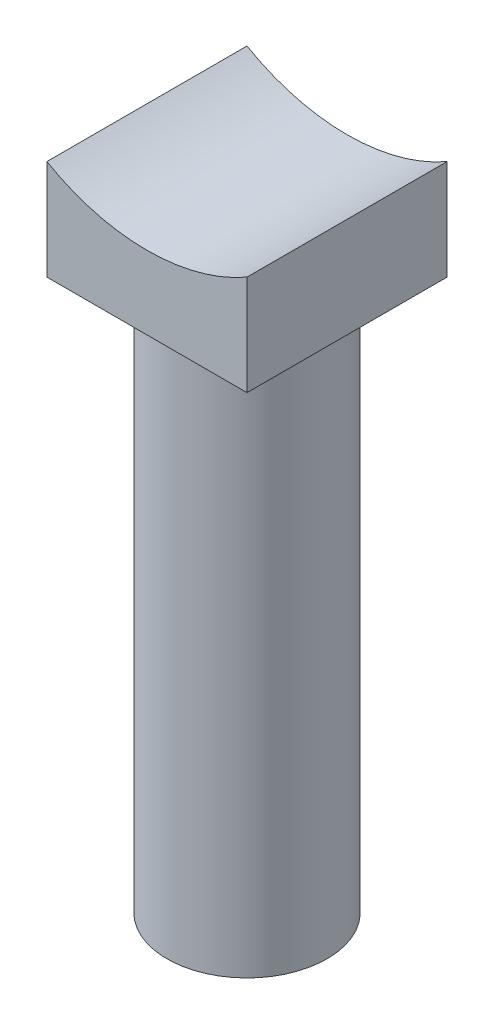
ISO-10303-21;
HEADER;
FILE_DESCRIPTION(('STEP AP214'),'2;1');
FILE_NAME('part.step','',(''),(''),'','','');
FILE_SCHEMA(('AUTOMOTIVE_DESIGN { 1 0 10303 214 1 1 1 1 }'));
ENDSEC;
DATA;
#1=APPLICATION_CONTEXT('core data for automotive mechanical design processes');
#2=APPLICATION_PROTOCOL_DEFINITION('international standard','automotive_design',2000,#1);
#3=PRODUCT_CONTEXT('',#1,'mechanical');
#4=PRODUCT('Part','Part','',(#3));
#5=PRODUCT_RELATED_PRODUCT_CATEGORY('part','',(#4));
#6=PRODUCT_DEFINITION_FORMATION('','',#4);
#7=PRODUCT_DEFINITION_CONTEXT('part definition',#1,'design');
#8=PRODUCT_DEFINITION('design','',#6,#7);
#9=PRODUCT_DEFINITION_SHAPE('','',#8);
#10=(LENGTH_UNIT() NAMED_UNIT(*) SI_UNIT(.MILLI.,.METRE.));
#11=(NAMED_UNIT(*) PLANE_ANGLE_UNIT() SI_UNIT($,.RADIAN.));
#12=(NAMED_UNIT(*) SI_UNIT($,.STERADIAN.) SOLID_ANGLE_UNIT());
#13=UNCERTAINTY_MEASURE_WITH_UNIT(LENGTH_MEASURE(1.E-05),#10,'distance_accuracy_value','');
#14=(GEOMETRIC_REPRESENTATION_CONTEXT(3) GLOBAL_UNCERTAINTY_ASSIGNED_CONTEXT((#13)) GLOBAL_UNIT_ASSIGNED_CONTEXT((#10,
#11,#12)) REPRESENTATION_CONTEXT('',''));
#15=CARTESIAN_POINT('',(0.,0.,0.));
#16=DIRECTION('',(0.,0.,1.));
#17=DIRECTION('',(1.,0.,0.));
#18=AXIS2_PLACEMENT_3D('',#15,#16,#17);
#19=CARTESIAN_POINT('',(10.,27.3205080756888,20.));
#20=DIRECTION('',(0.,0.,-1.));
#21=DIRECTION('',(-1.,0.,0.));
#22=AXIS2_PLACEMENT_3D('',#19,#20,#21);
#23=CYLINDRICAL_SURFACE('',#22,20.);
#24=CARTESIAN_POINT('',(10.,27.3205080756888,0.));
#25=DIRECTION('',(0.,0.,-1.));
#26=DIRECTION('',(1.,0.,0.));
#27=AXIS2_PLACEMENT_3D('',#24,#25,#26);
#28=CIRCLE('',#27,20.);
#29=CARTESIAN_POINT('',(20.,10.,0.));
#30=VERTEX_POINT('',#29);
#31=CARTESIAN_POINT('',(0.,10.,0.));
#32=VERTEX_POINT('',#31);
#33=EDGE_CURVE('E112',#30,#32,#28,.T.);
#34=ORIENTED_EDGE('',*,*,#33,.T.);
#35=DIRECTION('',(0.,0.,-1.));
#36=VECTOR('',#35,1.);
#37=CARTESIAN_POINT('',(0.,10.,20.));
#38=LINE('',#37,#36);
#39=CARTESIAN_POINT('',(0.,10.,20.));
#40=VERTEX_POINT('',#39);
#41=EDGE_CURVE('E44',#40,#32,#38,.T.);
#42=ORIENTED_EDGE('',*,*,#41,.F.);
#43=CARTESIAN_POINT('',(10.,27.3205080756888,20.));
#44=DIRECTION('',(0.,0.,-1.));
#45=DIRECTION('',(1.,0.,0.));
#46=AXIS2_PLACEMENT_3D('',#43,#44,#45);
#47=CIRCLE('',#46,20.);
#48=CARTESIAN_POINT('',(20.,10.,20.));
#49=VERTEX_POINT('',#48);
#50=EDGE_CURVE('E95',#49,#40,#47,.T.);
#51=ORIENTED_EDGE('',*,*,#50,.F.);
#52=DIRECTION('',(0.,0.,-1.));
#53=VECTOR('',#52,1.);
#54=CARTESIAN_POINT('',(20.,10.,20.));
#55=LINE('',#54,#53);
#56=EDGE_CURVE('E108',#49,#30,#55,.T.);
#57=ORIENTED_EDGE('',*,*,#56,.T.);
#58=EDGE_LOOP('',(#34,#42,#51,#57));
#59=FACE_BOUND('',#58,.T.);
#60=ADVANCED_FACE('F41',(#59),#23,.F.);
#61=CARTESIAN_POINT('',(0.,10.,20.));
#62=DIRECTION('',(1.,0.,0.));
#63=DIRECTION('',(0.,1.,0.));
#64=AXIS2_PLACEMENT_3D('',#61,#62,#63);
#65=PLANE('',#64);
#66=DIRECTION('',(0.,-1.,0.));
#67=VECTOR('',#66,1.);
#68=CARTESIAN_POINT('',(0.,10.,0.));
#69=LINE('',#68,#67);
#70=CARTESIAN_POINT('',(0.,0.,0.));
#71=VERTEX_POINT('',#70);
#72=EDGE_CURVE('E101',#32,#71,#69,.T.);
#73=ORIENTED_EDGE('',*,*,#72,.T.);
#74=DIRECTION('',(0.,0.,-1.));
#75=VECTOR('',#74,1.);
#76=CARTESIAN_POINT('',(0.,0.,20.));
#77=LINE('',#76,#75);
#78=CARTESIAN_POINT('',(0.,0.,20.));
#79=VERTEX_POINT('',#78);
#80=EDGE_CURVE('E99',#79,#71,#77,.T.);
#81=ORIENTED_EDGE('',*,*,#80,.F.);
#82=DIRECTION('',(0.,-1.,0.));
#83=VECTOR('',#82,1.);
#84=CARTESIAN_POINT('',(0.,10.,20.));
#85=LINE('',#84,#83);
#86=EDGE_CURVE('E90',#40,#79,#85,.T.);
#87=ORIENTED_EDGE('',*,*,#86,.F.);
#88=ORIENTED_EDGE('',*,*,#41,.T.);
#89=EDGE_LOOP('',(#73,#81,#87,#88));
#90=FACE_BOUND('',#89,.T.);
#91=ADVANCED_FACE('F100',(#90),#65,.F.);
#92=CARTESIAN_POINT('',(0.,0.,20.));
#93=DIRECTION('',(0.,1.,0.));
#94=DIRECTION('',(0.,0.,1.));
#95=AXIS2_PLACEMENT_3D('',#92,#93,#94);
#96=PLANE('',#95);
#97=CARTESIAN_POINT('',(10.,0.,10.));
#98=DIRECTION('',(0.,-1.,0.));
#99=DIRECTION('',(0.,0.,-1.));
#100=AXIS2_PLACEMENT_3D('',#97,#98,#99);
#101=CIRCLE('',#100,8.);
#102=CARTESIAN_POINT('',(10.,0.,2.));
#103=VERTEX_POINT('',#102);
#104=EDGE_CURVE('E11',#103,#103,#101,.T.);
#105=ORIENTED_EDGE('',*,*,#104,.F.);
#106=EDGE_LOOP('',(#105));
#107=FACE_BOUND('',#106,.T.);
#108=DIRECTION('',(1.,0.,0.));
#109=VECTOR('',#108,1.);
#110=CARTESIAN_POINT('',(0.,0.,0.));
#111=LINE('',#110,#109);
#112=CARTESIAN_POINT('',(20.,0.,0.));
#113=VERTEX_POINT('',#112);
#114=EDGE_CURVE('E76',#71,#113,#111,.T.);
#115=ORIENTED_EDGE('',*,*,#114,.T.);
#116=DIRECTION('',(0.,0.,-1.));
#117=VECTOR('',#116,1.);
#118=CARTESIAN_POINT('',(20.,0.,20.));
#119=LINE('',#118,#117);
#120=CARTESIAN_POINT('',(20.,0.,20.));
#121=VERTEX_POINT('',#120);
#122=EDGE_CURVE('E103',#121,#113,#119,.T.);
#123=ORIENTED_EDGE('',*,*,#122,.F.);
#124=DIRECTION('',(1.,0.,0.));
#125=VECTOR('',#124,1.);
#126=CARTESIAN_POINT('',(0.,0.,20.));
#127=LINE('',#126,#125);
#128=EDGE_CURVE('E93',#79,#121,#127,.T.);
#129=ORIENTED_EDGE('',*,*,#128,.F.);
#130=ORIENTED_EDGE('',*,*,#80,.T.);
#131=EDGE_LOOP('',(#115,#123,#129,#130));
#132=FACE_BOUND('',#131,.T.);
#133=ADVANCED_FACE('F104',(#107,#132),#96,.F.);
#134=CARTESIAN_POINT('',(20.,10.,20.));
#135=DIRECTION('',(-1.,0.,0.));
#136=DIRECTION('',(0.,0.,1.));
#137=AXIS2_PLACEMENT_3D('',#134,#135,#136);
#138=PLANE('',#137);
#139=DIRECTION('',(0.,1.,0.));
#140=VECTOR('',#139,1.);
#141=CARTESIAN_POINT('',(20.,10.,0.));
#142=LINE('',#141,#140);
#143=EDGE_CURVE('E82',#113,#30,#142,.T.);
#144=ORIENTED_EDGE('',*,*,#143,.T.);
#145=ORIENTED_EDGE('',*,*,#56,.F.);
#146=DIRECTION('',(0.,1.,0.));
#147=VECTOR('',#146,1.);
#148=CARTESIAN_POINT('',(20.,10.,20.));
#149=LINE('',#148,#147);
#150=EDGE_CURVE('E59',#121,#49,#149,.T.);
#151=ORIENTED_EDGE('',*,*,#150,.F.);
#152=ORIENTED_EDGE('',*,*,#122,.T.);
#153=EDGE_LOOP('',(#144,#145,#151,#152));
#154=FACE_BOUND('',#153,.T.);
#155=ADVANCED_FACE('F126',(#154),#138,.F.);
#156=CARTESIAN_POINT('',(10.,27.3205080756888,20.));
#157=DIRECTION('',(0.,0.,1.));
#158=DIRECTION('',(1.,0.,0.));
#159=AXIS2_PLACEMENT_3D('',#156,#157,#158);
#160=PLANE('',#159);
#161=ORIENTED_EDGE('',*,*,#50,.T.);
#162=ORIENTED_EDGE('',*,*,#86,.T.);
#163=ORIENTED_EDGE('',*,*,#128,.T.);
#164=ORIENTED_EDGE('',*,*,#150,.T.);
#165=EDGE_LOOP('',(#161,#162,#163,#164));
#166=FACE_BOUND('',#165,.T.);
#167=ADVANCED_FACE('F91',(#166),#160,.T.);
#168=CARTESIAN_POINT('',(10.,27.3205080756888,0.));
#169=DIRECTION('',(0.,0.,1.));
#170=DIRECTION('',(1.,0.,0.));
#171=AXIS2_PLACEMENT_3D('',#168,#169,#170);
#172=PLANE('',#171);
#173=ORIENTED_EDGE('',*,*,#33,.F.);
#174=ORIENTED_EDGE('',*,*,#143,.F.);
#175=ORIENTED_EDGE('',*,*,#114,.F.);
#176=ORIENTED_EDGE('',*,*,#72,.F.);
#177=EDGE_LOOP('',(#173,#174,#175,#176));
#178=FACE_BOUND('',#177,.T.);
#179=ADVANCED_FACE('F129',(#178),#172,.F.);
#180=CARTESIAN_POINT('',(10.,-55.,10.));
#181=DIRECTION('',(0.,1.,0.));
#182=DIRECTION('',(0.,0.,1.));
#183=AXIS2_PLACEMENT_3D('',#180,#181,#182);
#184=CYLINDRICAL_SURFACE('',#183,8.);
#185=CARTESIAN_POINT('',(10.,-55.,10.));
#186=DIRECTION('',(0.,-1.,0.));
#187=DIRECTION('',(0.,0.,-1.));
#188=AXIS2_PLACEMENT_3D('',#185,#186,#187);
#189=CIRCLE('',#188,8.);
#190=CARTESIAN_POINT('',(10.,-55.,2.));
#191=VERTEX_POINT('',#190);
#192=EDGE_CURVE('E116',#191,#191,#189,.T.);
#193=ORIENTED_EDGE('',*,*,#192,.F.);
#194=EDGE_LOOP('',(#193));
#195=FACE_BOUND('',#194,.T.);
#196=ORIENTED_EDGE('',*,*,#104,.T.);
#197=EDGE_LOOP('',(#196));
#198=FACE_BOUND('',#197,.T.);
#199=ADVANCED_FACE('F139',(#195,#198),#184,.T.);
#200=CARTESIAN_POINT('',(10.,-55.,10.));
#201=DIRECTION('',(0.,-1.,0.));
#202=DIRECTION('',(0.,0.,-1.));
#203=AXIS2_PLACEMENT_3D('',#200,#201,#202);
#204=PLANE('',#203);
#205=ORIENTED_EDGE('',*,*,#192,.T.);
#206=EDGE_LOOP('',(#205));
#207=FACE_BOUND('',#206,.T.);
#208=ADVANCED_FACE('F137',(#207),#204,.T.);
#209=CLOSED_SHELL('',(#60,#91,#133,#155,#167,#179,#199,#208));
#210=MANIFOLD_SOLID_BREP('B2',#209);
#211=ADVANCED_BREP_SHAPE_REPRESENTATION('',(#18,#210),#14);
#212=SHAPE_DEFINITION_REPRESENTATION(#9,#211);
ENDSEC;
END-ISO-10303-21;
